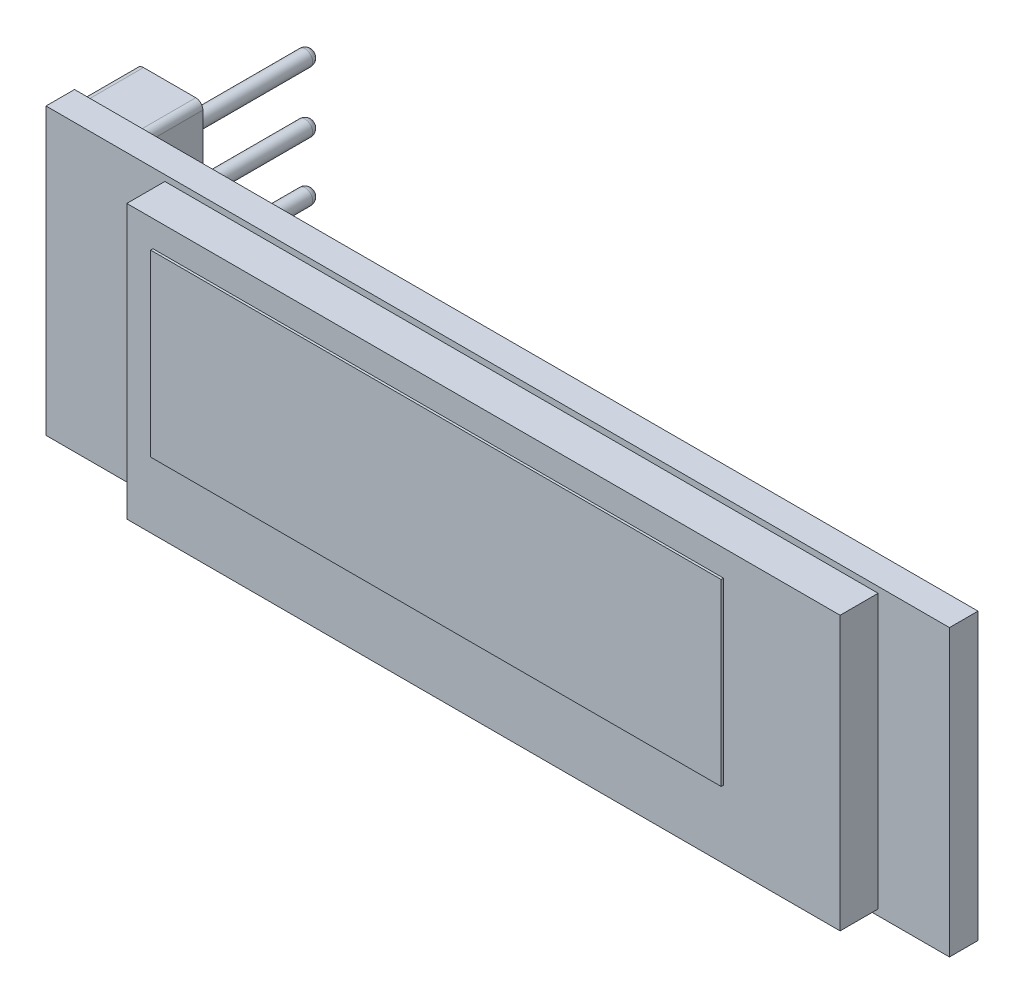
ISO-10303-21;
HEADER;
FILE_DESCRIPTION(('STEP AP214'),'2;1');
FILE_NAME('part.step','',(''),(''),'','','');
FILE_SCHEMA(('AUTOMOTIVE_DESIGN { 1 0 10303 214 1 1 1 1 }'));
ENDSEC;
DATA;
#1=APPLICATION_CONTEXT('core data for automotive mechanical design processes');
#2=APPLICATION_PROTOCOL_DEFINITION('international standard','automotive_design',2000,#1);
#3=PRODUCT_CONTEXT('',#1,'mechanical');
#4=PRODUCT('Part','Part','',(#3));
#5=PRODUCT_RELATED_PRODUCT_CATEGORY('part','',(#4));
#6=PRODUCT_DEFINITION_FORMATION('','',#4);
#7=PRODUCT_DEFINITION_CONTEXT('part definition',#1,'design');
#8=PRODUCT_DEFINITION('design','',#6,#7);
#9=PRODUCT_DEFINITION_SHAPE('','',#8);
#10=(LENGTH_UNIT() NAMED_UNIT(*) SI_UNIT(.MILLI.,.METRE.));
#11=(NAMED_UNIT(*) PLANE_ANGLE_UNIT() SI_UNIT($,.RADIAN.));
#12=(NAMED_UNIT(*) SI_UNIT($,.STERADIAN.) SOLID_ANGLE_UNIT());
#13=UNCERTAINTY_MEASURE_WITH_UNIT(LENGTH_MEASURE(1.E-05),#10,'distance_accuracy_value','');
#14=(GEOMETRIC_REPRESENTATION_CONTEXT(3) GLOBAL_UNCERTAINTY_ASSIGNED_CONTEXT((#13)) GLOBAL_UNIT_ASSIGNED_CONTEXT((#10,
#11,#12)) REPRESENTATION_CONTEXT('',''));
#15=CARTESIAN_POINT('',(0.,0.,0.));
#16=DIRECTION('',(0.,0.,1.));
#17=DIRECTION('',(1.,0.,0.));
#18=AXIS2_PLACEMENT_3D('',#15,#16,#17);
#19=CARTESIAN_POINT('',(0.,0.,2.8));
#20=DIRECTION('',(0.,0.,-1.));
#21=DIRECTION('',(-1.,0.,0.));
#22=AXIS2_PLACEMENT_3D('',#19,#20,#21);
#23=PLANE('',#22);
#24=DIRECTION('',(0.,1.,0.));
#25=VECTOR('',#24,1.);
#26=CARTESIAN_POINT('',(16.,-5.75,2.8));
#27=LINE('',#26,#25);
#28=CARTESIAN_POINT('',(16.,-5.75,2.8));
#29=VERTEX_POINT('',#28);
#30=CARTESIAN_POINT('',(16.,5.75,2.8));
#31=VERTEX_POINT('',#30);
#32=EDGE_CURVE('E246',#29,#31,#27,.T.);
#33=ORIENTED_EDGE('',*,*,#32,.T.);
#34=DIRECTION('',(-1.,0.,0.));
#35=VECTOR('',#34,1.);
#36=CARTESIAN_POINT('',(-14.,5.75,2.8));
#37=LINE('',#36,#35);
#38=CARTESIAN_POINT('',(-14.,5.75,2.8));
#39=VERTEX_POINT('',#38);
#40=EDGE_CURVE('E250',#31,#39,#37,.T.);
#41=ORIENTED_EDGE('',*,*,#40,.T.);
#42=DIRECTION('',(0.,-1.,0.));
#43=VECTOR('',#42,1.);
#44=CARTESIAN_POINT('',(-14.,-5.75,2.8));
#45=LINE('',#44,#43);
#46=CARTESIAN_POINT('',(-14.,-5.75,2.8));
#47=VERTEX_POINT('',#46);
#48=EDGE_CURVE('E254',#39,#47,#45,.T.);
#49=ORIENTED_EDGE('',*,*,#48,.T.);
#50=DIRECTION('',(1.,0.,0.));
#51=VECTOR('',#50,1.);
#52=CARTESIAN_POINT('',(-14.,-5.75,2.8));
#53=LINE('',#52,#51);
#54=EDGE_CURVE('E257',#47,#29,#53,.T.);
#55=ORIENTED_EDGE('',*,*,#54,.T.);
#56=EDGE_LOOP('',(#33,#41,#49,#55));
#57=FACE_BOUND('',#56,.T.);
#58=DIRECTION('',(0.,1.,0.));
#59=VECTOR('',#58,1.);
#60=CARTESIAN_POINT('',(11.1,4.65,2.8));
#61=LINE('',#60,#59);
#62=CARTESIAN_POINT('',(11.1,-2.89,2.8));
#63=VERTEX_POINT('',#62);
#64=CARTESIAN_POINT('',(11.1,4.65,2.8));
#65=VERTEX_POINT('',#64);
#66=EDGE_CURVE('E57',#63,#65,#61,.T.);
#67=ORIENTED_EDGE('',*,*,#66,.F.);
#68=DIRECTION('',(1.,0.,0.));
#69=VECTOR('',#68,1.);
#70=CARTESIAN_POINT('',(-12.9,-2.89,2.8));
#71=LINE('',#70,#69);
#72=CARTESIAN_POINT('',(-12.9,-2.89,2.8));
#73=VERTEX_POINT('',#72);
#74=EDGE_CURVE('E61',#73,#63,#71,.T.);
#75=ORIENTED_EDGE('',*,*,#74,.F.);
#76=DIRECTION('',(0.,-1.,0.));
#77=VECTOR('',#76,1.);
#78=CARTESIAN_POINT('',(-12.9,4.65,2.8));
#79=LINE('',#78,#77);
#80=CARTESIAN_POINT('',(-12.9,4.65,2.8));
#81=VERTEX_POINT('',#80);
#82=EDGE_CURVE('E791',#81,#73,#79,.T.);
#83=ORIENTED_EDGE('',*,*,#82,.F.);
#84=DIRECTION('',(-1.,0.,0.));
#85=VECTOR('',#84,1.);
#86=CARTESIAN_POINT('',(-12.9,4.65,2.8));
#87=LINE('',#86,#85);
#88=EDGE_CURVE('E801',#65,#81,#87,.T.);
#89=ORIENTED_EDGE('',*,*,#88,.F.);
#90=EDGE_LOOP('',(#67,#75,#83,#89));
#91=FACE_BOUND('',#90,.T.);
#92=ADVANCED_FACE('F41',(#57,#91),#23,.F.);
#93=CARTESIAN_POINT('',(0.,0.,0.));
#94=DIRECTION('',(0.,0.,1.));
#95=DIRECTION('',(1.,0.,0.));
#96=AXIS2_PLACEMENT_3D('',#93,#94,#95);
#97=PLANE('',#96);
#98=DIRECTION('',(0.,-1.,0.));
#99=VECTOR('',#98,1.);
#100=CARTESIAN_POINT('',(-19.,-6.,0.));
#101=LINE('',#100,#99);
#102=CARTESIAN_POINT('',(-19.,6.,0.));
#103=VERTEX_POINT('',#102);
#104=CARTESIAN_POINT('',(-19.,-6.,0.));
#105=VERTEX_POINT('',#104);
#106=EDGE_CURVE('E290',#103,#105,#101,.T.);
#107=ORIENTED_EDGE('',*,*,#106,.F.);
#108=DIRECTION('',(-1.,0.,0.));
#109=VECTOR('',#108,1.);
#110=CARTESIAN_POINT('',(19.,6.,0.));
#111=LINE('',#110,#109);
#112=CARTESIAN_POINT('',(19.,6.,0.));
#113=VERTEX_POINT('',#112);
#114=EDGE_CURVE('E296',#113,#103,#111,.T.);
#115=ORIENTED_EDGE('',*,*,#114,.F.);
#116=DIRECTION('',(0.,1.,0.));
#117=VECTOR('',#116,1.);
#118=CARTESIAN_POINT('',(19.,-6.,0.));
#119=LINE('',#118,#117);
#120=CARTESIAN_POINT('',(19.,-6.,0.));
#121=VERTEX_POINT('',#120);
#122=EDGE_CURVE('E312',#121,#113,#119,.T.);
#123=ORIENTED_EDGE('',*,*,#122,.F.);
#124=DIRECTION('',(1.,0.,0.));
#125=VECTOR('',#124,1.);
#126=CARTESIAN_POINT('',(19.,-6.,0.));
#127=LINE('',#126,#125);
#128=EDGE_CURVE('E309',#105,#121,#127,.T.);
#129=ORIENTED_EDGE('',*,*,#128,.F.);
#130=EDGE_LOOP('',(#107,#115,#123,#129));
#131=FACE_BOUND('',#130,.T.);
#132=DIRECTION('',(0.,-1.,0.));
#133=VECTOR('',#132,1.);
#134=CARTESIAN_POINT('',(-16.1,-5.75,0.));
#135=LINE('',#134,#133);
#136=CARTESIAN_POINT('',(-16.1,5.45,0.));
#137=VERTEX_POINT('',#136);
#138=CARTESIAN_POINT('',(-16.1,-5.45,0.));
#139=VERTEX_POINT('',#138);
#140=EDGE_CURVE('E230',#137,#139,#135,.T.);
#141=ORIENTED_EDGE('',*,*,#140,.F.);
#142=CARTESIAN_POINT('',(-16.4,5.45,0.));
#143=DIRECTION('',(0.,0.,1.));
#144=DIRECTION('',(1.,0.,0.));
#145=AXIS2_PLACEMENT_3D('',#142,#143,#144);
#146=CIRCLE('',#145,0.3);
#147=CARTESIAN_POINT('',(-16.4,5.75,0.));
#148=VERTEX_POINT('',#147);
#149=EDGE_CURVE('E414',#137,#148,#146,.T.);
#150=ORIENTED_EDGE('',*,*,#149,.T.);
#151=DIRECTION('',(1.,0.,0.));
#152=VECTOR('',#151,1.);
#153=CARTESIAN_POINT('',(-18.9,5.75,0.));
#154=LINE('',#153,#152);
#155=CARTESIAN_POINT('',(-18.6,5.75,0.));
#156=VERTEX_POINT('',#155);
#157=EDGE_CURVE('E217',#156,#148,#154,.T.);
#158=ORIENTED_EDGE('',*,*,#157,.F.);
#159=CARTESIAN_POINT('',(-18.6,5.45,0.));
#160=DIRECTION('',(0.,0.,1.));
#161=DIRECTION('',(1.,0.,0.));
#162=AXIS2_PLACEMENT_3D('',#159,#160,#161);
#163=CIRCLE('',#162,0.3);
#164=CARTESIAN_POINT('',(-18.9,5.45,0.));
#165=VERTEX_POINT('',#164);
#166=EDGE_CURVE('E417',#156,#165,#163,.T.);
#167=ORIENTED_EDGE('',*,*,#166,.T.);
#168=DIRECTION('',(0.,1.,0.));
#169=VECTOR('',#168,1.);
#170=CARTESIAN_POINT('',(-18.9,-5.75,0.));
#171=LINE('',#170,#169);
#172=CARTESIAN_POINT('',(-18.9,-5.45,0.));
#173=VERTEX_POINT('',#172);
#174=EDGE_CURVE('E239',#173,#165,#171,.T.);
#175=ORIENTED_EDGE('',*,*,#174,.F.);
#176=CARTESIAN_POINT('',(-18.6,-5.45,0.));
#177=DIRECTION('',(0.,0.,1.));
#178=DIRECTION('',(1.,0.,0.));
#179=AXIS2_PLACEMENT_3D('',#176,#177,#178);
#180=CIRCLE('',#179,0.3);
#181=CARTESIAN_POINT('',(-18.6,-5.75,0.));
#182=VERTEX_POINT('',#181);
#183=EDGE_CURVE('E11',#173,#182,#180,.T.);
#184=ORIENTED_EDGE('',*,*,#183,.T.);
#185=DIRECTION('',(-1.,0.,0.));
#186=VECTOR('',#185,1.);
#187=CARTESIAN_POINT('',(-18.9,-5.75,0.));
#188=LINE('',#187,#186);
#189=CARTESIAN_POINT('',(-16.4,-5.75,0.));
#190=VERTEX_POINT('',#189);
#191=EDGE_CURVE('E234',#190,#182,#188,.T.);
#192=ORIENTED_EDGE('',*,*,#191,.F.);
#193=CARTESIAN_POINT('',(-16.4,-5.45,0.));
#194=DIRECTION('',(0.,0.,1.));
#195=DIRECTION('',(1.,0.,0.));
#196=AXIS2_PLACEMENT_3D('',#193,#194,#195);
#197=CIRCLE('',#196,0.3);
#198=EDGE_CURVE('E50',#190,#139,#197,.T.);
#199=ORIENTED_EDGE('',*,*,#198,.T.);
#200=EDGE_LOOP('',(#141,#150,#158,#167,#175,#184,#192,#199));
#201=FACE_BOUND('',#200,.T.);
#202=ADVANCED_FACE('F423',(#131,#201),#97,.F.);
#203=CARTESIAN_POINT('',(-19.,-6.,1.2));
#204=DIRECTION('',(1.,0.,0.));
#205=DIRECTION('',(0.,0.,-1.));
#206=AXIS2_PLACEMENT_3D('',#203,#204,#205);
#207=PLANE('',#206);
#208=ORIENTED_EDGE('',*,*,#106,.T.);
#209=DIRECTION('',(0.,0.,-1.));
#210=VECTOR('',#209,1.);
#211=CARTESIAN_POINT('',(-19.,-6.,1.2));
#212=LINE('',#211,#210);
#213=CARTESIAN_POINT('',(-19.,-6.,1.2));
#214=VERTEX_POINT('',#213);
#215=EDGE_CURVE('E328',#214,#105,#212,.T.);
#216=ORIENTED_EDGE('',*,*,#215,.F.);
#217=DIRECTION('',(0.,-1.,0.));
#218=VECTOR('',#217,1.);
#219=CARTESIAN_POINT('',(-19.,-6.,1.2));
#220=LINE('',#219,#218);
#221=CARTESIAN_POINT('',(-19.,6.,1.2));
#222=VERTEX_POINT('',#221);
#223=EDGE_CURVE('E291',#222,#214,#220,.T.);
#224=ORIENTED_EDGE('',*,*,#223,.F.);
#225=DIRECTION('',(0.,0.,-1.));
#226=VECTOR('',#225,1.);
#227=CARTESIAN_POINT('',(-19.,6.,1.2));
#228=LINE('',#227,#226);
#229=EDGE_CURVE('E305',#222,#103,#228,.T.);
#230=ORIENTED_EDGE('',*,*,#229,.T.);
#231=EDGE_LOOP('',(#208,#216,#224,#230));
#232=FACE_BOUND('',#231,.T.);
#233=ADVANCED_FACE('F476',(#232),#207,.F.);
#234=CARTESIAN_POINT('',(19.,-6.,1.2));
#235=DIRECTION('',(0.,1.,0.));
#236=DIRECTION('',(-1.,0.,0.));
#237=AXIS2_PLACEMENT_3D('',#234,#235,#236);
#238=PLANE('',#237);
#239=ORIENTED_EDGE('',*,*,#128,.T.);
#240=DIRECTION('',(0.,0.,-1.));
#241=VECTOR('',#240,1.);
#242=CARTESIAN_POINT('',(19.,-6.,1.2));
#243=LINE('',#242,#241);
#244=CARTESIAN_POINT('',(19.,-6.,1.2));
#245=VERTEX_POINT('',#244);
#246=EDGE_CURVE('E324',#245,#121,#243,.T.);
#247=ORIENTED_EDGE('',*,*,#246,.F.);
#248=DIRECTION('',(1.,0.,0.));
#249=VECTOR('',#248,1.);
#250=CARTESIAN_POINT('',(19.,-6.,1.2));
#251=LINE('',#250,#249);
#252=EDGE_CURVE('E295',#214,#245,#251,.T.);
#253=ORIENTED_EDGE('',*,*,#252,.F.);
#254=ORIENTED_EDGE('',*,*,#215,.T.);
#255=EDGE_LOOP('',(#239,#247,#253,#254));
#256=FACE_BOUND('',#255,.T.);
#257=ADVANCED_FACE('F509',(#256),#238,.F.);
#258=CARTESIAN_POINT('',(19.,-6.,1.2));
#259=DIRECTION('',(-1.,0.,0.));
#260=DIRECTION('',(0.,0.,1.));
#261=AXIS2_PLACEMENT_3D('',#258,#259,#260);
#262=PLANE('',#261);
#263=ORIENTED_EDGE('',*,*,#122,.T.);
#264=DIRECTION('',(0.,0.,-1.));
#265=VECTOR('',#264,1.);
#266=CARTESIAN_POINT('',(19.,6.,1.2));
#267=LINE('',#266,#265);
#268=CARTESIAN_POINT('',(19.,6.,1.2));
#269=VERTEX_POINT('',#268);
#270=EDGE_CURVE('E320',#269,#113,#267,.T.);
#271=ORIENTED_EDGE('',*,*,#270,.F.);
#272=DIRECTION('',(0.,1.,0.));
#273=VECTOR('',#272,1.);
#274=CARTESIAN_POINT('',(19.,-6.,1.2));
#275=LINE('',#274,#273);
#276=EDGE_CURVE('E299',#245,#269,#275,.T.);
#277=ORIENTED_EDGE('',*,*,#276,.F.);
#278=ORIENTED_EDGE('',*,*,#246,.T.);
#279=EDGE_LOOP('',(#263,#271,#277,#278));
#280=FACE_BOUND('',#279,.T.);
#281=ADVANCED_FACE('F505',(#280),#262,.F.);
#282=CARTESIAN_POINT('',(19.,6.,1.2));
#283=DIRECTION('',(0.,-1.,0.));
#284=DIRECTION('',(1.,0.,0.));
#285=AXIS2_PLACEMENT_3D('',#282,#283,#284);
#286=PLANE('',#285);
#287=ORIENTED_EDGE('',*,*,#114,.T.);
#288=ORIENTED_EDGE('',*,*,#229,.F.);
#289=DIRECTION('',(-1.,0.,0.));
#290=VECTOR('',#289,1.);
#291=CARTESIAN_POINT('',(19.,6.,1.2));
#292=LINE('',#291,#290);
#293=EDGE_CURVE('E302',#269,#222,#292,.T.);
#294=ORIENTED_EDGE('',*,*,#293,.F.);
#295=ORIENTED_EDGE('',*,*,#270,.T.);
#296=EDGE_LOOP('',(#287,#288,#294,#295));
#297=FACE_BOUND('',#296,.T.);
#298=ADVANCED_FACE('F500',(#297),#286,.F.);
#299=CARTESIAN_POINT('',(0.,0.,1.2));
#300=DIRECTION('',(0.,0.,1.));
#301=DIRECTION('',(1.,0.,0.));
#302=AXIS2_PLACEMENT_3D('',#299,#300,#301);
#303=PLANE('',#302);
#304=DIRECTION('',(0.,1.,0.));
#305=VECTOR('',#304,1.);
#306=CARTESIAN_POINT('',(16.,-5.75,1.2));
#307=LINE('',#306,#305);
#308=CARTESIAN_POINT('',(16.,-5.75,1.2));
#309=VERTEX_POINT('',#308);
#310=CARTESIAN_POINT('',(16.,5.75,1.2));
#311=VERTEX_POINT('',#310);
#312=EDGE_CURVE('E229',#309,#311,#307,.T.);
#313=ORIENTED_EDGE('',*,*,#312,.F.);
#314=DIRECTION('',(1.,0.,0.));
#315=VECTOR('',#314,1.);
#316=CARTESIAN_POINT('',(-14.,-5.75,1.2));
#317=LINE('',#316,#315);
#318=CARTESIAN_POINT('',(-14.,-5.75,1.2));
#319=VERTEX_POINT('',#318);
#320=EDGE_CURVE('E251',#319,#309,#317,.T.);
#321=ORIENTED_EDGE('',*,*,#320,.F.);
#322=DIRECTION('',(0.,-1.,0.));
#323=VECTOR('',#322,1.);
#324=CARTESIAN_POINT('',(-14.,-5.75,1.2));
#325=LINE('',#324,#323);
#326=CARTESIAN_POINT('',(-14.,5.75,1.2));
#327=VERTEX_POINT('',#326);
#328=EDGE_CURVE('E268',#327,#319,#325,.T.);
#329=ORIENTED_EDGE('',*,*,#328,.F.);
#330=DIRECTION('',(-1.,0.,0.));
#331=VECTOR('',#330,1.);
#332=CARTESIAN_POINT('',(-14.,5.75,1.2));
#333=LINE('',#332,#331);
#334=EDGE_CURVE('E264',#311,#327,#333,.T.);
#335=ORIENTED_EDGE('',*,*,#334,.F.);
#336=EDGE_LOOP('',(#313,#321,#329,#335));
#337=FACE_BOUND('',#336,.T.);
#338=ORIENTED_EDGE('',*,*,#223,.T.);
#339=ORIENTED_EDGE('',*,*,#252,.T.);
#340=ORIENTED_EDGE('',*,*,#276,.T.);
#341=ORIENTED_EDGE('',*,*,#293,.T.);
#342=EDGE_LOOP('',(#338,#339,#340,#341));
#343=FACE_BOUND('',#342,.T.);
#344=ADVANCED_FACE('F497',(#337,#343),#303,.T.);
#345=CARTESIAN_POINT('',(16.,-5.75,2.8));
#346=DIRECTION('',(-1.,0.,0.));
#347=DIRECTION('',(0.,0.,1.));
#348=AXIS2_PLACEMENT_3D('',#345,#346,#347);
#349=PLANE('',#348);
#350=ORIENTED_EDGE('',*,*,#312,.T.);
#351=DIRECTION('',(0.,0.,-1.));
#352=VECTOR('',#351,1.);
#353=CARTESIAN_POINT('',(16.,5.75,2.8));
#354=LINE('',#353,#352);
#355=EDGE_CURVE('E286',#31,#311,#354,.T.);
#356=ORIENTED_EDGE('',*,*,#355,.F.);
#357=ORIENTED_EDGE('',*,*,#32,.F.);
#358=DIRECTION('',(0.,0.,-1.));
#359=VECTOR('',#358,1.);
#360=CARTESIAN_POINT('',(16.,-5.75,2.8));
#361=LINE('',#360,#359);
#362=EDGE_CURVE('E260',#29,#309,#361,.T.);
#363=ORIENTED_EDGE('',*,*,#362,.T.);
#364=EDGE_LOOP('',(#350,#356,#357,#363));
#365=FACE_BOUND('',#364,.T.);
#366=ADVANCED_FACE('F493',(#365),#349,.F.);
#367=CARTESIAN_POINT('',(-14.,5.75,2.8));
#368=DIRECTION('',(0.,-1.,0.));
#369=DIRECTION('',(0.,0.,-1.));
#370=AXIS2_PLACEMENT_3D('',#367,#368,#369);
#371=PLANE('',#370);
#372=ORIENTED_EDGE('',*,*,#334,.T.);
#373=DIRECTION('',(0.,0.,-1.));
#374=VECTOR('',#373,1.);
#375=CARTESIAN_POINT('',(-14.,5.75,2.8));
#376=LINE('',#375,#374);
#377=EDGE_CURVE('E282',#39,#327,#376,.T.);
#378=ORIENTED_EDGE('',*,*,#377,.F.);
#379=ORIENTED_EDGE('',*,*,#40,.F.);
#380=ORIENTED_EDGE('',*,*,#355,.T.);
#381=EDGE_LOOP('',(#372,#378,#379,#380));
#382=FACE_BOUND('',#381,.T.);
#383=ADVANCED_FACE('F489',(#382),#371,.F.);
#384=CARTESIAN_POINT('',(-14.,-5.75,2.8));
#385=DIRECTION('',(1.,0.,0.));
#386=DIRECTION('',(0.,0.,-1.));
#387=AXIS2_PLACEMENT_3D('',#384,#385,#386);
#388=PLANE('',#387);
#389=ORIENTED_EDGE('',*,*,#328,.T.);
#390=DIRECTION('',(0.,0.,-1.));
#391=VECTOR('',#390,1.);
#392=CARTESIAN_POINT('',(-14.,-5.75,2.8));
#393=LINE('',#392,#391);
#394=EDGE_CURVE('E278',#47,#319,#393,.T.);
#395=ORIENTED_EDGE('',*,*,#394,.F.);
#396=ORIENTED_EDGE('',*,*,#48,.F.);
#397=ORIENTED_EDGE('',*,*,#377,.T.);
#398=EDGE_LOOP('',(#389,#395,#396,#397));
#399=FACE_BOUND('',#398,.T.);
#400=ADVANCED_FACE('F485',(#399),#388,.F.);
#401=CARTESIAN_POINT('',(-14.,-5.75,2.8));
#402=DIRECTION('',(0.,1.,0.));
#403=DIRECTION('',(0.,0.,1.));
#404=AXIS2_PLACEMENT_3D('',#401,#402,#403);
#405=PLANE('',#404);
#406=ORIENTED_EDGE('',*,*,#320,.T.);
#407=ORIENTED_EDGE('',*,*,#362,.F.);
#408=ORIENTED_EDGE('',*,*,#54,.F.);
#409=ORIENTED_EDGE('',*,*,#394,.T.);
#410=EDGE_LOOP('',(#406,#407,#408,#409));
#411=FACE_BOUND('',#410,.T.);
#412=ADVANCED_FACE('F482',(#411),#405,.F.);
#413=CARTESIAN_POINT('',(-16.1,-5.75,-2.5));
#414=DIRECTION('',(-1.,0.,0.));
#415=DIRECTION('',(0.,0.,1.));
#416=AXIS2_PLACEMENT_3D('',#413,#414,#415);
#417=PLANE('',#416);
#418=DIRECTION('',(0.,-1.,0.));
#419=VECTOR('',#418,1.);
#420=CARTESIAN_POINT('',(-16.1,-5.75,-2.5));
#421=LINE('',#420,#419);
#422=CARTESIAN_POINT('',(-16.1,5.45,-2.5));
#423=VERTEX_POINT('',#422);
#424=CARTESIAN_POINT('',(-16.1,-5.45,-2.5));
#425=VERTEX_POINT('',#424);
#426=EDGE_CURVE('E212',#423,#425,#421,.T.);
#427=ORIENTED_EDGE('',*,*,#426,.F.);
#428=DIRECTION('',(0.,0.,1.));
#429=VECTOR('',#428,1.);
#430=CARTESIAN_POINT('',(-16.1,5.45,-2.5));
#431=LINE('',#430,#429);
#432=EDGE_CURVE('E377',#423,#137,#431,.T.);
#433=ORIENTED_EDGE('',*,*,#432,.T.);
#434=ORIENTED_EDGE('',*,*,#140,.T.);
#435=DIRECTION('',(0.,0.,1.));
#436=VECTOR('',#435,1.);
#437=CARTESIAN_POINT('',(-16.1,-5.45,-2.5));
#438=LINE('',#437,#436);
#439=EDGE_CURVE('E374',#139,#425,#438,.F.);
#440=ORIENTED_EDGE('',*,*,#439,.T.);
#441=EDGE_LOOP('',(#427,#433,#434,#440));
#442=FACE_BOUND('',#441,.T.);
#443=ADVANCED_FACE('F429',(#442),#417,.F.);
#444=CARTESIAN_POINT('',(-18.9,-5.75,-2.5));
#445=DIRECTION('',(0.,1.,0.));
#446=DIRECTION('',(0.,0.,1.));
#447=AXIS2_PLACEMENT_3D('',#444,#445,#446);
#448=PLANE('',#447);
#449=DIRECTION('',(-1.,0.,0.));
#450=VECTOR('',#449,1.);
#451=CARTESIAN_POINT('',(-18.9,-5.75,-2.5));
#452=LINE('',#451,#450);
#453=CARTESIAN_POINT('',(-16.4,-5.75,-2.5));
#454=VERTEX_POINT('',#453);
#455=CARTESIAN_POINT('',(-18.6,-5.75,-2.5));
#456=VERTEX_POINT('',#455);
#457=EDGE_CURVE('E216',#454,#456,#452,.T.);
#458=ORIENTED_EDGE('',*,*,#457,.F.);
#459=DIRECTION('',(0.,0.,1.));
#460=VECTOR('',#459,1.);
#461=CARTESIAN_POINT('',(-16.4,-5.75,-2.5));
#462=LINE('',#461,#460);
#463=EDGE_CURVE('E410',#454,#190,#462,.T.);
#464=ORIENTED_EDGE('',*,*,#463,.T.);
#465=ORIENTED_EDGE('',*,*,#191,.T.);
#466=DIRECTION('',(0.,0.,1.));
#467=VECTOR('',#466,1.);
#468=CARTESIAN_POINT('',(-18.6,-5.75,-2.5));
#469=LINE('',#468,#467);
#470=EDGE_CURVE('E407',#182,#456,#469,.F.);
#471=ORIENTED_EDGE('',*,*,#470,.T.);
#472=EDGE_LOOP('',(#458,#464,#465,#471));
#473=FACE_BOUND('',#472,.T.);
#474=ADVANCED_FACE('F438',(#473),#448,.F.);
#475=CARTESIAN_POINT('',(-18.9,-5.75,-2.5));
#476=DIRECTION('',(1.,0.,0.));
#477=DIRECTION('',(0.,0.,-1.));
#478=AXIS2_PLACEMENT_3D('',#475,#476,#477);
#479=PLANE('',#478);
#480=ORIENTED_EDGE('',*,*,#174,.T.);
#481=DIRECTION('',(0.,0.,1.));
#482=VECTOR('',#481,1.);
#483=CARTESIAN_POINT('',(-18.9,5.45,-2.5));
#484=LINE('',#483,#482);
#485=CARTESIAN_POINT('',(-18.9,5.45,-2.5));
#486=VERTEX_POINT('',#485);
#487=EDGE_CURVE('E404',#165,#486,#484,.F.);
#488=ORIENTED_EDGE('',*,*,#487,.T.);
#489=DIRECTION('',(0.,1.,0.));
#490=VECTOR('',#489,1.);
#491=CARTESIAN_POINT('',(-18.9,-5.75,-2.5));
#492=LINE('',#491,#490);
#493=CARTESIAN_POINT('',(-18.9,-5.45,-2.5));
#494=VERTEX_POINT('',#493);
#495=EDGE_CURVE('E221',#494,#486,#492,.T.);
#496=ORIENTED_EDGE('',*,*,#495,.F.);
#497=DIRECTION('',(0.,0.,1.));
#498=VECTOR('',#497,1.);
#499=CARTESIAN_POINT('',(-18.9,-5.45,-2.5));
#500=LINE('',#499,#498);
#501=EDGE_CURVE('E400',#494,#173,#500,.T.);
#502=ORIENTED_EDGE('',*,*,#501,.T.);
#503=EDGE_LOOP('',(#480,#488,#496,#502));
#504=FACE_BOUND('',#503,.T.);
#505=ADVANCED_FACE('F445',(#504),#479,.F.);
#506=CARTESIAN_POINT('',(-18.9,5.75,-2.5));
#507=DIRECTION('',(0.,-1.,0.));
#508=DIRECTION('',(0.,0.,-1.));
#509=AXIS2_PLACEMENT_3D('',#506,#507,#508);
#510=PLANE('',#509);
#511=ORIENTED_EDGE('',*,*,#157,.T.);
#512=DIRECTION('',(0.,0.,1.));
#513=VECTOR('',#512,1.);
#514=CARTESIAN_POINT('',(-16.4,5.75,-2.5));
#515=LINE('',#514,#513);
#516=CARTESIAN_POINT('',(-16.4,5.75,-2.5));
#517=VERTEX_POINT('',#516);
#518=EDGE_CURVE('E385',#148,#517,#515,.F.);
#519=ORIENTED_EDGE('',*,*,#518,.T.);
#520=DIRECTION('',(1.,0.,0.));
#521=VECTOR('',#520,1.);
#522=CARTESIAN_POINT('',(-18.9,5.75,-2.5));
#523=LINE('',#522,#521);
#524=CARTESIAN_POINT('',(-18.6,5.75,-2.5));
#525=VERTEX_POINT('',#524);
#526=EDGE_CURVE('E225',#525,#517,#523,.T.);
#527=ORIENTED_EDGE('',*,*,#526,.F.);
#528=DIRECTION('',(0.,0.,1.));
#529=VECTOR('',#528,1.);
#530=CARTESIAN_POINT('',(-18.6,5.75,-2.5));
#531=LINE('',#530,#529);
#532=EDGE_CURVE('E381',#525,#156,#531,.T.);
#533=ORIENTED_EDGE('',*,*,#532,.T.);
#534=EDGE_LOOP('',(#511,#519,#527,#533));
#535=FACE_BOUND('',#534,.T.);
#536=ADVANCED_FACE('F454',(#535),#510,.F.);
#537=CARTESIAN_POINT('',(0.,0.,-2.5));
#538=DIRECTION('',(0.,0.,-1.));
#539=DIRECTION('',(-1.,0.,0.));
#540=AXIS2_PLACEMENT_3D('',#537,#538,#539);
#541=PLANE('',#540);
#542=CARTESIAN_POINT('',(-17.5,-3.81,-2.5));
#543=DIRECTION('',(0.,0.,-1.));
#544=DIRECTION('',(-1.,0.,0.));
#545=AXIS2_PLACEMENT_3D('',#542,#543,#544);
#546=CIRCLE('',#545,0.32);
#547=CARTESIAN_POINT('',(-17.82,-3.81,-2.5));
#548=VERTEX_POINT('',#547);
#549=EDGE_CURVE('E201',#548,#548,#546,.F.);
#550=ORIENTED_EDGE('',*,*,#549,.T.);
#551=EDGE_LOOP('',(#550));
#552=FACE_BOUND('',#551,.T.);
#553=CARTESIAN_POINT('',(-17.5,-1.25,-2.5));
#554=DIRECTION('',(0.,0.,-1.));
#555=DIRECTION('',(-1.,0.,0.));
#556=AXIS2_PLACEMENT_3D('',#553,#554,#555);
#557=CIRCLE('',#556,0.32);
#558=CARTESIAN_POINT('',(-17.82,-1.25,-2.5));
#559=VERTEX_POINT('',#558);
#560=EDGE_CURVE('E206',#559,#559,#557,.F.);
#561=ORIENTED_EDGE('',*,*,#560,.T.);
#562=EDGE_LOOP('',(#561));
#563=FACE_BOUND('',#562,.T.);
#564=CARTESIAN_POINT('',(-17.5,1.25,-2.5));
#565=DIRECTION('',(0.,0.,-1.));
#566=DIRECTION('',(-1.,0.,0.));
#567=AXIS2_PLACEMENT_3D('',#564,#565,#566);
#568=CIRCLE('',#567,0.32);
#569=CARTESIAN_POINT('',(-17.82,1.25,-2.5));
#570=VERTEX_POINT('',#569);
#571=EDGE_CURVE('E336',#570,#570,#568,.F.);
#572=ORIENTED_EDGE('',*,*,#571,.T.);
#573=EDGE_LOOP('',(#572));
#574=FACE_BOUND('',#573,.T.);
#575=CARTESIAN_POINT('',(-17.5,3.81,-2.5));
#576=DIRECTION('',(0.,0.,-1.));
#577=DIRECTION('',(-1.,0.,0.));
#578=AXIS2_PLACEMENT_3D('',#575,#576,#577);
#579=CIRCLE('',#578,0.32);
#580=CARTESIAN_POINT('',(-17.82,3.81,-2.5));
#581=VERTEX_POINT('',#580);
#582=EDGE_CURVE('E235',#581,#581,#579,.F.);
#583=ORIENTED_EDGE('',*,*,#582,.T.);
#584=EDGE_LOOP('',(#583));
#585=FACE_BOUND('',#584,.T.);
#586=ORIENTED_EDGE('',*,*,#526,.T.);
#587=CARTESIAN_POINT('',(-16.4,5.45,-2.5));
#588=DIRECTION('',(0.,0.,-1.));
#589=DIRECTION('',(-1.,0.,0.));
#590=AXIS2_PLACEMENT_3D('',#587,#588,#589);
#591=CIRCLE('',#590,0.3);
#592=EDGE_CURVE('E397',#517,#423,#591,.T.);
#593=ORIENTED_EDGE('',*,*,#592,.T.);
#594=ORIENTED_EDGE('',*,*,#426,.T.);
#595=CARTESIAN_POINT('',(-16.4,-5.45,-2.5));
#596=DIRECTION('',(0.,0.,-1.));
#597=DIRECTION('',(-1.,0.,0.));
#598=AXIS2_PLACEMENT_3D('',#595,#596,#597);
#599=CIRCLE('',#598,0.3);
#600=EDGE_CURVE('E391',#425,#454,#599,.T.);
#601=ORIENTED_EDGE('',*,*,#600,.T.);
#602=ORIENTED_EDGE('',*,*,#457,.T.);
#603=CARTESIAN_POINT('',(-18.6,-5.45,-2.5));
#604=DIRECTION('',(0.,0.,-1.));
#605=DIRECTION('',(-1.,0.,0.));
#606=AXIS2_PLACEMENT_3D('',#603,#604,#605);
#607=CIRCLE('',#606,0.3);
#608=EDGE_CURVE('E388',#456,#494,#607,.T.);
#609=ORIENTED_EDGE('',*,*,#608,.T.);
#610=ORIENTED_EDGE('',*,*,#495,.T.);
#611=CARTESIAN_POINT('',(-18.6,5.45,-2.5));
#612=DIRECTION('',(0.,0.,-1.));
#613=DIRECTION('',(-1.,0.,0.));
#614=AXIS2_PLACEMENT_3D('',#611,#612,#613);
#615=CIRCLE('',#614,0.3);
#616=EDGE_CURVE('E394',#486,#525,#615,.T.);
#617=ORIENTED_EDGE('',*,*,#616,.T.);
#618=EDGE_LOOP('',(#586,#593,#594,#601,#602,#609,#610,#617));
#619=FACE_BOUND('',#618,.T.);
#620=ADVANCED_FACE('F435',(#552,#563,#574,#585,#619),#541,.T.);
#621=CARTESIAN_POINT('',(-17.5,3.81,-8.5));
#622=DIRECTION('',(0.,0.,1.));
#623=DIRECTION('',(1.,0.,0.));
#624=AXIS2_PLACEMENT_3D('',#621,#622,#623);
#625=CYLINDRICAL_SURFACE('',#624,0.32);
#626=CARTESIAN_POINT('',(-17.5,3.81,-8.2));
#627=DIRECTION('',(0.,0.,-1.));
#628=DIRECTION('',(-1.,0.,0.));
#629=AXIS2_PLACEMENT_3D('',#626,#627,#628);
#630=CIRCLE('',#629,0.32);
#631=CARTESIAN_POINT('',(-17.82,3.81,-8.2));
#632=VERTEX_POINT('',#631);
#633=EDGE_CURVE('E370',#632,#632,#630,.F.);
#634=ORIENTED_EDGE('',*,*,#633,.T.);
#635=EDGE_LOOP('',(#634));
#636=FACE_BOUND('',#635,.T.);
#637=ORIENTED_EDGE('',*,*,#582,.F.);
#638=EDGE_LOOP('',(#637));
#639=FACE_BOUND('',#638,.T.);
#640=ADVANCED_FACE('F553',(#636,#639),#625,.T.);
#641=CARTESIAN_POINT('',(-17.5,3.81,-8.5));
#642=DIRECTION('',(0.,0.,-1.));
#643=DIRECTION('',(-1.,0.,0.));
#644=AXIS2_PLACEMENT_3D('',#641,#642,#643);
#645=PLANE('',#644);
#646=CARTESIAN_POINT('',(-17.5,3.81,-8.5));
#647=DIRECTION('',(0.,0.,-1.));
#648=DIRECTION('',(-1.,0.,0.));
#649=AXIS2_PLACEMENT_3D('',#646,#647,#648);
#650=CIRCLE('',#649,0.0200000000000004);
#651=CARTESIAN_POINT('',(-17.52,3.81,-8.5));
#652=VERTEX_POINT('',#651);
#653=EDGE_CURVE('E366',#652,#652,#650,.T.);
#654=ORIENTED_EDGE('',*,*,#653,.T.);
#655=EDGE_LOOP('',(#654));
#656=FACE_BOUND('',#655,.T.);
#657=ADVANCED_FACE('F546',(#656),#645,.T.);
#658=CARTESIAN_POINT('',(-17.5,1.25,-8.5));
#659=DIRECTION('',(0.,0.,1.));
#660=DIRECTION('',(1.,0.,0.));
#661=AXIS2_PLACEMENT_3D('',#658,#659,#660);
#662=CYLINDRICAL_SURFACE('',#661,0.32);
#663=CARTESIAN_POINT('',(-17.5,1.25,-8.2));
#664=DIRECTION('',(0.,0.,-1.));
#665=DIRECTION('',(-1.,0.,0.));
#666=AXIS2_PLACEMENT_3D('',#663,#664,#665);
#667=CIRCLE('',#666,0.32);
#668=CARTESIAN_POINT('',(-17.82,1.25,-8.2));
#669=VERTEX_POINT('',#668);
#670=EDGE_CURVE('E362',#669,#669,#667,.F.);
#671=ORIENTED_EDGE('',*,*,#670,.T.);
#672=EDGE_LOOP('',(#671));
#673=FACE_BOUND('',#672,.T.);
#674=ORIENTED_EDGE('',*,*,#571,.F.);
#675=EDGE_LOOP('',(#674));
#676=FACE_BOUND('',#675,.T.);
#677=ADVANCED_FACE('F537',(#673,#676),#662,.T.);
#678=CARTESIAN_POINT('',(-17.5,1.25,-8.5));
#679=DIRECTION('',(0.,0.,-1.));
#680=DIRECTION('',(-1.,0.,0.));
#681=AXIS2_PLACEMENT_3D('',#678,#679,#680);
#682=PLANE('',#681);
#683=CARTESIAN_POINT('',(-17.5,1.25,-8.5));
#684=DIRECTION('',(0.,0.,-1.));
#685=DIRECTION('',(-1.,0.,0.));
#686=AXIS2_PLACEMENT_3D('',#683,#684,#685);
#687=CIRCLE('',#686,0.0200000000000004);
#688=CARTESIAN_POINT('',(-17.52,1.25,-8.5));
#689=VERTEX_POINT('',#688);
#690=EDGE_CURVE('E358',#689,#689,#687,.T.);
#691=ORIENTED_EDGE('',*,*,#690,.T.);
#692=EDGE_LOOP('',(#691));
#693=FACE_BOUND('',#692,.T.);
#694=ADVANCED_FACE('F534',(#693),#682,.T.);
#695=CARTESIAN_POINT('',(-17.5,-1.25,-8.5));
#696=DIRECTION('',(0.,0.,1.));
#697=DIRECTION('',(1.,0.,0.));
#698=AXIS2_PLACEMENT_3D('',#695,#696,#697);
#699=CYLINDRICAL_SURFACE('',#698,0.32);
#700=CARTESIAN_POINT('',(-17.5,-1.25,-8.2));
#701=DIRECTION('',(0.,0.,-1.));
#702=DIRECTION('',(-1.,0.,0.));
#703=AXIS2_PLACEMENT_3D('',#700,#701,#702);
#704=CIRCLE('',#703,0.32);
#705=CARTESIAN_POINT('',(-17.82,-1.25,-8.2));
#706=VERTEX_POINT('',#705);
#707=EDGE_CURVE('E354',#706,#706,#704,.F.);
#708=ORIENTED_EDGE('',*,*,#707,.T.);
#709=EDGE_LOOP('',(#708));
#710=FACE_BOUND('',#709,.T.);
#711=ORIENTED_EDGE('',*,*,#560,.F.);
#712=EDGE_LOOP('',(#711));
#713=FACE_BOUND('',#712,.T.);
#714=ADVANCED_FACE('F536',(#710,#713),#699,.T.);
#715=CARTESIAN_POINT('',(-17.5,-1.25,-8.5));
#716=DIRECTION('',(0.,0.,-1.));
#717=DIRECTION('',(-1.,0.,0.));
#718=AXIS2_PLACEMENT_3D('',#715,#716,#717);
#719=PLANE('',#718);
#720=CARTESIAN_POINT('',(-17.5,-1.25,-8.5));
#721=DIRECTION('',(0.,0.,-1.));
#722=DIRECTION('',(-1.,0.,0.));
#723=AXIS2_PLACEMENT_3D('',#720,#721,#722);
#724=CIRCLE('',#723,0.0200000000000004);
#725=CARTESIAN_POINT('',(-17.52,-1.25,-8.5));
#726=VERTEX_POINT('',#725);
#727=EDGE_CURVE('E350',#726,#726,#724,.T.);
#728=ORIENTED_EDGE('',*,*,#727,.T.);
#729=EDGE_LOOP('',(#728));
#730=FACE_BOUND('',#729,.T.);
#731=ADVANCED_FACE('F543',(#730),#719,.T.);
#732=CARTESIAN_POINT('',(-17.5,-3.81,-8.5));
#733=DIRECTION('',(0.,0.,1.));
#734=DIRECTION('',(1.,0.,0.));
#735=AXIS2_PLACEMENT_3D('',#732,#733,#734);
#736=CYLINDRICAL_SURFACE('',#735,0.32);
#737=CARTESIAN_POINT('',(-17.5,-3.81,-8.2));
#738=DIRECTION('',(0.,0.,-1.));
#739=DIRECTION('',(-1.,0.,0.));
#740=AXIS2_PLACEMENT_3D('',#737,#738,#739);
#741=CIRCLE('',#740,0.32);
#742=CARTESIAN_POINT('',(-17.82,-3.81,-8.2));
#743=VERTEX_POINT('',#742);
#744=EDGE_CURVE('E346',#743,#743,#741,.F.);
#745=ORIENTED_EDGE('',*,*,#744,.T.);
#746=EDGE_LOOP('',(#745));
#747=FACE_BOUND('',#746,.T.);
#748=ORIENTED_EDGE('',*,*,#549,.F.);
#749=EDGE_LOOP('',(#748));
#750=FACE_BOUND('',#749,.T.);
#751=ADVANCED_FACE('F643',(#747,#750),#736,.T.);
#752=CARTESIAN_POINT('',(-17.5,-3.81,-8.5));
#753=DIRECTION('',(0.,0.,-1.));
#754=DIRECTION('',(-1.,0.,0.));
#755=AXIS2_PLACEMENT_3D('',#752,#753,#754);
#756=PLANE('',#755);
#757=CARTESIAN_POINT('',(-17.5,-3.81,-8.5));
#758=DIRECTION('',(0.,0.,-1.));
#759=DIRECTION('',(-1.,0.,0.));
#760=AXIS2_PLACEMENT_3D('',#757,#758,#759);
#761=CIRCLE('',#760,0.0200000000000004);
#762=CARTESIAN_POINT('',(-17.52,-3.81,-8.5));
#763=VERTEX_POINT('',#762);
#764=EDGE_CURVE('E332',#763,#763,#761,.T.);
#765=ORIENTED_EDGE('',*,*,#764,.T.);
#766=EDGE_LOOP('',(#765));
#767=FACE_BOUND('',#766,.T.);
#768=ADVANCED_FACE('F521',(#767),#756,.T.);
#769=CARTESIAN_POINT('',(-17.5,-3.81,-8.2));
#770=DIRECTION('',(0.,0.,-1.));
#771=DIRECTION('',(-1.,0.,0.));
#772=AXIS2_PLACEMENT_3D('',#769,#770,#771);
#773=DEGENERATE_TOROIDAL_SURFACE('',#772,0.0200000000000004,0.3,.T.);
#774=ORIENTED_EDGE('',*,*,#744,.F.);
#775=EDGE_LOOP('',(#774));
#776=FACE_BOUND('',#775,.T.);
#777=ORIENTED_EDGE('',*,*,#764,.F.);
#778=EDGE_LOOP('',(#777));
#779=FACE_BOUND('',#778,.T.);
#780=ADVANCED_FACE('F517',(#776,#779),#773,.T.);
#781=CARTESIAN_POINT('',(-17.5,-1.25,-8.2));
#782=DIRECTION('',(0.,0.,-1.));
#783=DIRECTION('',(-1.,0.,0.));
#784=AXIS2_PLACEMENT_3D('',#781,#782,#783);
#785=DEGENERATE_TOROIDAL_SURFACE('',#784,0.0200000000000004,0.3,.T.);
#786=ORIENTED_EDGE('',*,*,#707,.F.);
#787=EDGE_LOOP('',(#786));
#788=FACE_BOUND('',#787,.T.);
#789=ORIENTED_EDGE('',*,*,#727,.F.);
#790=EDGE_LOOP('',(#789));
#791=FACE_BOUND('',#790,.T.);
#792=ADVANCED_FACE('F520',(#788,#791),#785,.T.);
#793=CARTESIAN_POINT('',(-17.5,1.25,-8.2));
#794=DIRECTION('',(0.,0.,-1.));
#795=DIRECTION('',(-1.,0.,0.));
#796=AXIS2_PLACEMENT_3D('',#793,#794,#795);
#797=DEGENERATE_TOROIDAL_SURFACE('',#796,0.0200000000000004,0.3,.T.);
#798=ORIENTED_EDGE('',*,*,#670,.F.);
#799=EDGE_LOOP('',(#798));
#800=FACE_BOUND('',#799,.T.);
#801=ORIENTED_EDGE('',*,*,#690,.F.);
#802=EDGE_LOOP('',(#801));
#803=FACE_BOUND('',#802,.T.);
#804=ADVANCED_FACE('F467',(#800,#803),#797,.T.);
#805=CARTESIAN_POINT('',(-17.5,3.81,-8.2));
#806=DIRECTION('',(0.,0.,-1.));
#807=DIRECTION('',(-1.,0.,0.));
#808=AXIS2_PLACEMENT_3D('',#805,#806,#807);
#809=DEGENERATE_TOROIDAL_SURFACE('',#808,0.0200000000000004,0.3,.T.);
#810=ORIENTED_EDGE('',*,*,#633,.F.);
#811=EDGE_LOOP('',(#810));
#812=FACE_BOUND('',#811,.T.);
#813=ORIENTED_EDGE('',*,*,#653,.F.);
#814=EDGE_LOOP('',(#813));
#815=FACE_BOUND('',#814,.T.);
#816=ADVANCED_FACE('F460',(#812,#815),#809,.T.);
#817=CARTESIAN_POINT('',(-16.4,5.45,-2.5));
#818=DIRECTION('',(0.,0.,1.));
#819=DIRECTION('',(1.,0.,0.));
#820=AXIS2_PLACEMENT_3D('',#817,#818,#819);
#821=CYLINDRICAL_SURFACE('',#820,0.3);
#822=ORIENTED_EDGE('',*,*,#592,.F.);
#823=ORIENTED_EDGE('',*,*,#518,.F.);
#824=ORIENTED_EDGE('',*,*,#149,.F.);
#825=ORIENTED_EDGE('',*,*,#432,.F.);
#826=EDGE_LOOP('',(#822,#823,#824,#825));
#827=FACE_BOUND('',#826,.T.);
#828=ADVANCED_FACE('F458',(#827),#821,.T.);
#829=CARTESIAN_POINT('',(-18.6,5.45,-2.5));
#830=DIRECTION('',(0.,0.,1.));
#831=DIRECTION('',(1.,0.,0.));
#832=AXIS2_PLACEMENT_3D('',#829,#830,#831);
#833=CYLINDRICAL_SURFACE('',#832,0.3);
#834=ORIENTED_EDGE('',*,*,#616,.F.);
#835=ORIENTED_EDGE('',*,*,#487,.F.);
#836=ORIENTED_EDGE('',*,*,#166,.F.);
#837=ORIENTED_EDGE('',*,*,#532,.F.);
#838=EDGE_LOOP('',(#834,#835,#836,#837));
#839=FACE_BOUND('',#838,.T.);
#840=ADVANCED_FACE('F449',(#839),#833,.T.);
#841=CARTESIAN_POINT('',(-16.4,-5.45,-2.5));
#842=DIRECTION('',(0.,0.,1.));
#843=DIRECTION('',(1.,0.,0.));
#844=AXIS2_PLACEMENT_3D('',#841,#842,#843);
#845=CYLINDRICAL_SURFACE('',#844,0.3);
#846=ORIENTED_EDGE('',*,*,#600,.F.);
#847=ORIENTED_EDGE('',*,*,#439,.F.);
#848=ORIENTED_EDGE('',*,*,#198,.F.);
#849=ORIENTED_EDGE('',*,*,#463,.F.);
#850=EDGE_LOOP('',(#846,#847,#848,#849));
#851=FACE_BOUND('',#850,.T.);
#852=ADVANCED_FACE('F432',(#851),#845,.T.);
#853=CARTESIAN_POINT('',(-18.6,-5.45,-2.5));
#854=DIRECTION('',(0.,0.,1.));
#855=DIRECTION('',(1.,0.,0.));
#856=AXIS2_PLACEMENT_3D('',#853,#854,#855);
#857=CYLINDRICAL_SURFACE('',#856,0.3);
#858=ORIENTED_EDGE('',*,*,#608,.F.);
#859=ORIENTED_EDGE('',*,*,#470,.F.);
#860=ORIENTED_EDGE('',*,*,#183,.F.);
#861=ORIENTED_EDGE('',*,*,#501,.F.);
#862=EDGE_LOOP('',(#858,#859,#860,#861));
#863=FACE_BOUND('',#862,.T.);
#864=ADVANCED_FACE('F43',(#863),#857,.T.);
#865=CARTESIAN_POINT('',(11.1,4.65,2.9));
#866=DIRECTION('',(-1.,0.,0.));
#867=DIRECTION('',(0.,-1.,0.));
#868=AXIS2_PLACEMENT_3D('',#865,#866,#867);
#869=PLANE('',#868);
#870=ORIENTED_EDGE('',*,*,#66,.T.);
#871=DIRECTION('',(0.,0.,-1.));
#872=VECTOR('',#871,1.);
#873=CARTESIAN_POINT('',(11.1,4.65,2.9));
#874=LINE('',#873,#872);
#875=CARTESIAN_POINT('',(11.1,4.65,2.9));
#876=VERTEX_POINT('',#875);
#877=EDGE_CURVE('E181',#876,#65,#874,.T.);
#878=ORIENTED_EDGE('',*,*,#877,.F.);
#879=DIRECTION('',(0.,1.,0.));
#880=VECTOR('',#879,1.);
#881=CARTESIAN_POINT('',(11.1,4.65,2.9));
#882=LINE('',#881,#880);
#883=CARTESIAN_POINT('',(11.1,-2.89,2.9));
#884=VERTEX_POINT('',#883);
#885=EDGE_CURVE('E188',#884,#876,#882,.T.);
#886=ORIENTED_EDGE('',*,*,#885,.F.);
#887=DIRECTION('',(0.,0.,-1.));
#888=VECTOR('',#887,1.);
#889=CARTESIAN_POINT('',(11.1,-2.89,2.9));
#890=LINE('',#889,#888);
#891=EDGE_CURVE('E788',#884,#63,#890,.T.);
#892=ORIENTED_EDGE('',*,*,#891,.T.);
#893=EDGE_LOOP('',(#870,#878,#886,#892));
#894=FACE_BOUND('',#893,.T.);
#895=ADVANCED_FACE('F199',(#894),#869,.F.);
#896=CARTESIAN_POINT('',(-12.9,4.65,2.9));
#897=DIRECTION('',(0.,-1.,0.));
#898=DIRECTION('',(0.,0.,-1.));
#899=AXIS2_PLACEMENT_3D('',#896,#897,#898);
#900=PLANE('',#899);
#901=ORIENTED_EDGE('',*,*,#88,.T.);
#902=DIRECTION('',(0.,0.,-1.));
#903=VECTOR('',#902,1.);
#904=CARTESIAN_POINT('',(-12.9,4.65,2.9));
#905=LINE('',#904,#903);
#906=CARTESIAN_POINT('',(-12.9,4.65,2.9));
#907=VERTEX_POINT('',#906);
#908=EDGE_CURVE('E183',#907,#81,#905,.T.);
#909=ORIENTED_EDGE('',*,*,#908,.F.);
#910=DIRECTION('',(-1.,0.,0.));
#911=VECTOR('',#910,1.);
#912=CARTESIAN_POINT('',(-12.9,4.65,2.9));
#913=LINE('',#912,#911);
#914=EDGE_CURVE('E176',#876,#907,#913,.T.);
#915=ORIENTED_EDGE('',*,*,#914,.F.);
#916=ORIENTED_EDGE('',*,*,#877,.T.);
#917=EDGE_LOOP('',(#901,#909,#915,#916));
#918=FACE_BOUND('',#917,.T.);
#919=ADVANCED_FACE('F179',(#918),#900,.F.);
#920=CARTESIAN_POINT('',(-12.9,4.65,2.9));
#921=DIRECTION('',(1.,0.,0.));
#922=DIRECTION('',(0.,0.,-1.));
#923=AXIS2_PLACEMENT_3D('',#920,#921,#922);
#924=PLANE('',#923);
#925=ORIENTED_EDGE('',*,*,#82,.T.);
#926=DIRECTION('',(0.,0.,-1.));
#927=VECTOR('',#926,1.);
#928=CARTESIAN_POINT('',(-12.9,-2.89,2.9));
#929=LINE('',#928,#927);
#930=CARTESIAN_POINT('',(-12.9,-2.89,2.9));
#931=VERTEX_POINT('',#930);
#932=EDGE_CURVE('E208',#931,#73,#929,.T.);
#933=ORIENTED_EDGE('',*,*,#932,.F.);
#934=DIRECTION('',(0.,-1.,0.));
#935=VECTOR('',#934,1.);
#936=CARTESIAN_POINT('',(-12.9,4.65,2.9));
#937=LINE('',#936,#935);
#938=EDGE_CURVE('E187',#907,#931,#937,.T.);
#939=ORIENTED_EDGE('',*,*,#938,.F.);
#940=ORIENTED_EDGE('',*,*,#908,.T.);
#941=EDGE_LOOP('',(#925,#933,#939,#940));
#942=FACE_BOUND('',#941,.T.);
#943=ADVANCED_FACE('F756',(#942),#924,.F.);
#944=CARTESIAN_POINT('',(-12.9,-2.89,2.9));
#945=DIRECTION('',(0.,1.,0.));
#946=DIRECTION('',(0.,0.,1.));
#947=AXIS2_PLACEMENT_3D('',#944,#945,#946);
#948=PLANE('',#947);
#949=ORIENTED_EDGE('',*,*,#74,.T.);
#950=ORIENTED_EDGE('',*,*,#891,.F.);
#951=DIRECTION('',(1.,0.,0.));
#952=VECTOR('',#951,1.);
#953=CARTESIAN_POINT('',(-12.9,-2.89,2.9));
#954=LINE('',#953,#952);
#955=EDGE_CURVE('E193',#931,#884,#954,.T.);
#956=ORIENTED_EDGE('',*,*,#955,.F.);
#957=ORIENTED_EDGE('',*,*,#932,.T.);
#958=EDGE_LOOP('',(#949,#950,#956,#957));
#959=FACE_BOUND('',#958,.T.);
#960=ADVANCED_FACE('F765',(#959),#948,.F.);
#961=CARTESIAN_POINT('',(0.,0.,2.9));
#962=DIRECTION('',(0.,0.,1.));
#963=DIRECTION('',(1.,0.,0.));
#964=AXIS2_PLACEMENT_3D('',#961,#962,#963);
#965=PLANE('',#964);
#966=ORIENTED_EDGE('',*,*,#885,.T.);
#967=ORIENTED_EDGE('',*,*,#914,.T.);
#968=ORIENTED_EDGE('',*,*,#938,.T.);
#969=ORIENTED_EDGE('',*,*,#955,.T.);
#970=EDGE_LOOP('',(#966,#967,#968,#969));
#971=FACE_BOUND('',#970,.T.);
#972=ADVANCED_FACE('F191',(#971),#965,.T.);
#973=CLOSED_SHELL('',(#92,#202,#233,#257,#281,#298,#344,#366,#383,#400,#412,#443,#474,#505,#536,
#620,#640,#657,#677,#694,#714,#731,#751,#768,#780,#792,#804,#816,#828,#840,#852,#864,#895,#919,
#943,#960,#972));
#974=MANIFOLD_SOLID_BREP('B2',#973);
#975=ADVANCED_BREP_SHAPE_REPRESENTATION('',(#18,#974),#14);
#976=SHAPE_DEFINITION_REPRESENTATION(#9,#975);
ENDSEC;
END-ISO-10303-21;
